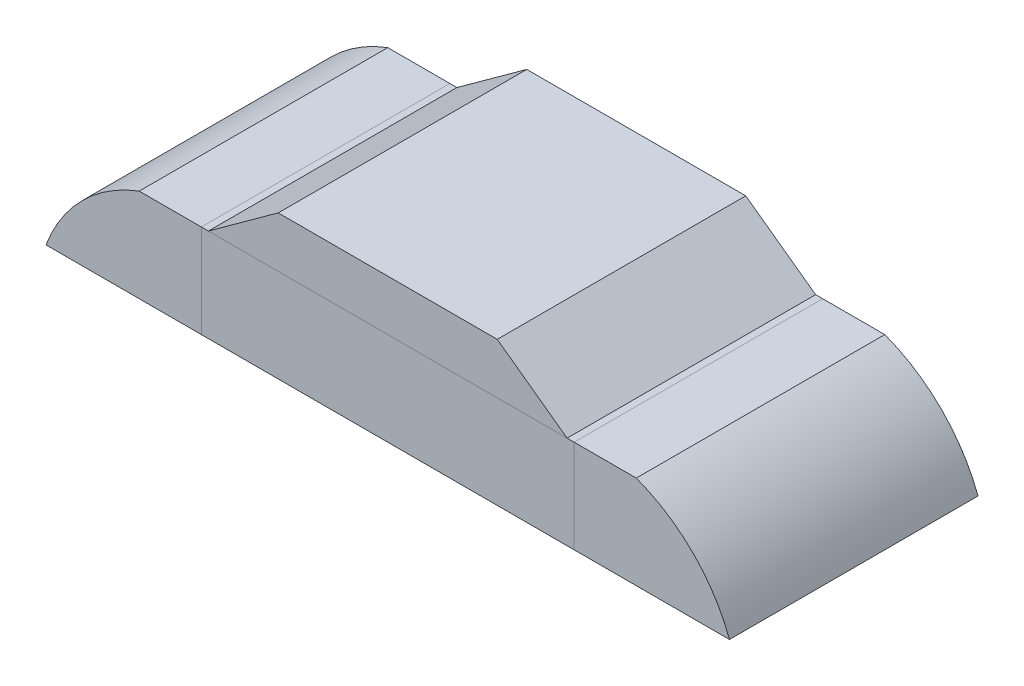
ISO-10303-21;
HEADER;
FILE_DESCRIPTION(('STEP AP214'),'2;1');
FILE_NAME('part.step','',(''),(''),'','','');
FILE_SCHEMA(('AUTOMOTIVE_DESIGN { 1 0 10303 214 1 1 1 1 }'));
ENDSEC;
DATA;
#1=APPLICATION_CONTEXT('core data for automotive mechanical design processes');
#2=APPLICATION_PROTOCOL_DEFINITION('international standard','automotive_design',2000,#1);
#3=PRODUCT_CONTEXT('',#1,'mechanical');
#4=PRODUCT('Part','Part','',(#3));
#5=PRODUCT_RELATED_PRODUCT_CATEGORY('part','',(#4));
#6=PRODUCT_DEFINITION_FORMATION('','',#4);
#7=PRODUCT_DEFINITION_CONTEXT('part definition',#1,'design');
#8=PRODUCT_DEFINITION('design','',#6,#7);
#9=PRODUCT_DEFINITION_SHAPE('','',#8);
#10=(LENGTH_UNIT() NAMED_UNIT(*) SI_UNIT(.MILLI.,.METRE.));
#11=(NAMED_UNIT(*) PLANE_ANGLE_UNIT() SI_UNIT($,.RADIAN.));
#12=(NAMED_UNIT(*) SI_UNIT($,.STERADIAN.) SOLID_ANGLE_UNIT());
#13=UNCERTAINTY_MEASURE_WITH_UNIT(LENGTH_MEASURE(1.E-05),#10,'distance_accuracy_value','');
#14=(GEOMETRIC_REPRESENTATION_CONTEXT(3) GLOBAL_UNCERTAINTY_ASSIGNED_CONTEXT((#13)) GLOBAL_UNIT_ASSIGNED_CONTEXT((#10,
#11,#12)) REPRESENTATION_CONTEXT('',''));
#15=CARTESIAN_POINT('',(0.,0.,0.));
#16=DIRECTION('',(0.,0.,1.));
#17=DIRECTION('',(1.,0.,0.));
#18=AXIS2_PLACEMENT_3D('',#15,#16,#17);
#19=CARTESIAN_POINT('',(0.577336188721218,0.3,0.4));
#20=DIRECTION('',(-0.586919453401064,-0.809645326806371,0.));
#21=DIRECTION('',(0.809645326806372,-0.586919453401064,0.));
#22=AXIS2_PLACEMENT_3D('',#19,#20,#21);
#23=PLANE('',#22);
#24=DIRECTION('',(-0.809645326806372,0.586919453401064,0.));
#25=VECTOR('',#24,1.);
#26=CARTESIAN_POINT('',(0.577336188721218,0.3,-0.4));
#27=LINE('',#26,#25);
#28=CARTESIAN_POINT('',(0.577336188721218,0.3,-0.4));
#29=VERTEX_POINT('',#28);
#30=CARTESIAN_POINT('',(0.352430123235442,0.463036505802082,-0.4));
#31=VERTEX_POINT('',#30);
#32=EDGE_CURVE('E109',#29,#31,#27,.T.);
#33=ORIENTED_EDGE('',*,*,#32,.T.);
#34=DIRECTION('',(0.,0.,-1.));
#35=VECTOR('',#34,1.);
#36=CARTESIAN_POINT('',(0.352430123235442,0.463036505802082,0.4));
#37=LINE('',#36,#35);
#38=CARTESIAN_POINT('',(0.352430123235442,0.463036505802082,0.4));
#39=VERTEX_POINT('',#38);
#40=EDGE_CURVE('E12',#39,#31,#37,.T.);
#41=ORIENTED_EDGE('',*,*,#40,.F.);
#42=DIRECTION('',(-0.809645326806372,0.586919453401064,0.));
#43=VECTOR('',#42,1.);
#44=CARTESIAN_POINT('',(0.577336188721218,0.3,0.4));
#45=LINE('',#44,#43);
#46=CARTESIAN_POINT('',(0.577336188721218,0.3,0.4));
#47=VERTEX_POINT('',#46);
#48=EDGE_CURVE('E97',#47,#39,#45,.T.);
#49=ORIENTED_EDGE('',*,*,#48,.F.);
#50=DIRECTION('',(0.,0.,-1.));
#51=VECTOR('',#50,1.);
#52=CARTESIAN_POINT('',(0.577336188721218,0.3,0.4));
#53=LINE('',#52,#51);
#54=EDGE_CURVE('E105',#47,#29,#53,.T.);
#55=ORIENTED_EDGE('',*,*,#54,.T.);
#56=EDGE_LOOP('',(#33,#41,#49,#55));
#57=FACE_BOUND('',#56,.T.);
#58=ADVANCED_FACE('F46',(#57),#23,.F.);
#59=CARTESIAN_POINT('',(0.352430123235442,0.463036505802082,0.4));
#60=DIRECTION('',(0.,-1.,0.));
#61=DIRECTION('',(0.,0.,-1.));
#62=AXIS2_PLACEMENT_3D('',#59,#60,#61);
#63=PLANE('',#62);
#64=DIRECTION('',(-1.,0.,0.));
#65=VECTOR('',#64,1.);
#66=CARTESIAN_POINT('',(0.352430123235442,0.463036505802082,-0.4));
#67=LINE('',#66,#65);
#68=CARTESIAN_POINT('',(-0.352430123235442,0.463036505802082,-0.4));
#69=VERTEX_POINT('',#68);
#70=EDGE_CURVE('E101',#31,#69,#67,.T.);
#71=ORIENTED_EDGE('',*,*,#70,.T.);
#72=DIRECTION('',(0.,0.,-1.));
#73=VECTOR('',#72,1.);
#74=CARTESIAN_POINT('',(-0.352430123235442,0.463036505802082,0.4));
#75=LINE('',#74,#73);
#76=CARTESIAN_POINT('',(-0.352430123235442,0.463036505802082,0.4));
#77=VERTEX_POINT('',#76);
#78=EDGE_CURVE('E54',#77,#69,#75,.T.);
#79=ORIENTED_EDGE('',*,*,#78,.F.);
#80=DIRECTION('',(-1.,0.,0.));
#81=VECTOR('',#80,1.);
#82=CARTESIAN_POINT('',(0.352430123235442,0.463036505802082,0.4));
#83=LINE('',#82,#81);
#84=EDGE_CURVE('E92',#39,#77,#83,.T.);
#85=ORIENTED_EDGE('',*,*,#84,.F.);
#86=ORIENTED_EDGE('',*,*,#40,.T.);
#87=EDGE_LOOP('',(#71,#79,#85,#86));
#88=FACE_BOUND('',#87,.T.);
#89=ADVANCED_FACE('F100',(#88),#63,.F.);
#90=CARTESIAN_POINT('',(-0.352430123235442,0.463036505802082,0.4));
#91=DIRECTION('',(0.586919453401064,-0.809645326806371,0.));
#92=DIRECTION('',(0.809645326806372,0.586919453401064,0.));
#93=AXIS2_PLACEMENT_3D('',#90,#91,#92);
#94=PLANE('',#93);
#95=DIRECTION('',(-0.809645326806372,-0.586919453401064,0.));
#96=VECTOR('',#95,1.);
#97=CARTESIAN_POINT('',(-0.352430123235442,0.463036505802082,-0.4));
#98=LINE('',#97,#96);
#99=CARTESIAN_POINT('',(-0.577336188721218,0.3,-0.4));
#100=VERTEX_POINT('',#99);
#101=EDGE_CURVE('E79',#69,#100,#98,.T.);
#102=ORIENTED_EDGE('',*,*,#101,.T.);
#103=DIRECTION('',(0.,0.,-1.));
#104=VECTOR('',#103,1.);
#105=CARTESIAN_POINT('',(-0.577336188721218,0.3,0.4));
#106=LINE('',#105,#104);
#107=CARTESIAN_POINT('',(-0.577336188721218,0.3,0.4));
#108=VERTEX_POINT('',#107);
#109=EDGE_CURVE('E102',#108,#100,#106,.T.);
#110=ORIENTED_EDGE('',*,*,#109,.F.);
#111=DIRECTION('',(-0.809645326806372,-0.586919453401064,0.));
#112=VECTOR('',#111,1.);
#113=CARTESIAN_POINT('',(-0.352430123235442,0.463036505802082,0.4));
#114=LINE('',#113,#112);
#115=EDGE_CURVE('E95',#77,#108,#114,.T.);
#116=ORIENTED_EDGE('',*,*,#115,.F.);
#117=ORIENTED_EDGE('',*,*,#78,.T.);
#118=EDGE_LOOP('',(#102,#110,#116,#117));
#119=FACE_BOUND('',#118,.T.);
#120=ADVANCED_FACE('F103',(#119),#94,.F.);
#121=CARTESIAN_POINT('',(0.577336188721218,0.3,0.4));
#122=DIRECTION('',(0.,1.,0.));
#123=DIRECTION('',(0.,0.,1.));
#124=AXIS2_PLACEMENT_3D('',#121,#122,#123);
#125=PLANE('',#124);
#126=DIRECTION('',(1.,0.,0.));
#127=VECTOR('',#126,1.);
#128=CARTESIAN_POINT('',(0.577336188721218,0.3,-0.4));
#129=LINE('',#128,#127);
#130=EDGE_CURVE('E85',#100,#29,#129,.T.);
#131=ORIENTED_EDGE('',*,*,#130,.T.);
#132=ORIENTED_EDGE('',*,*,#54,.F.);
#133=DIRECTION('',(1.,0.,0.));
#134=VECTOR('',#133,1.);
#135=CARTESIAN_POINT('',(0.577336188721218,0.3,0.4));
#136=LINE('',#135,#134);
#137=EDGE_CURVE('E62',#108,#47,#136,.T.);
#138=ORIENTED_EDGE('',*,*,#137,.F.);
#139=ORIENTED_EDGE('',*,*,#109,.T.);
#140=EDGE_LOOP('',(#131,#132,#138,#139));
#141=FACE_BOUND('',#140,.T.);
#142=ADVANCED_FACE('F116',(#141),#125,.F.);
#143=CARTESIAN_POINT('',(0.,0.,0.4));
#144=DIRECTION('',(0.,0.,1.));
#145=DIRECTION('',(1.,0.,0.));
#146=AXIS2_PLACEMENT_3D('',#143,#144,#145);
#147=PLANE('',#146);
#148=ORIENTED_EDGE('',*,*,#48,.T.);
#149=ORIENTED_EDGE('',*,*,#84,.T.);
#150=ORIENTED_EDGE('',*,*,#115,.T.);
#151=ORIENTED_EDGE('',*,*,#137,.T.);
#152=EDGE_LOOP('',(#148,#149,#150,#151));
#153=FACE_BOUND('',#152,.T.);
#154=ADVANCED_FACE('F93',(#153),#147,.T.);
#155=CARTESIAN_POINT('',(0.,0.,-0.4));
#156=DIRECTION('',(0.,0.,1.));
#157=DIRECTION('',(1.,0.,0.));
#158=AXIS2_PLACEMENT_3D('',#155,#156,#157);
#159=PLANE('',#158);
#160=ORIENTED_EDGE('',*,*,#32,.F.);
#161=ORIENTED_EDGE('',*,*,#130,.F.);
#162=ORIENTED_EDGE('',*,*,#101,.F.);
#163=ORIENTED_EDGE('',*,*,#70,.F.);
#164=EDGE_LOOP('',(#160,#161,#162,#163));
#165=FACE_BOUND('',#164,.T.);
#166=ADVANCED_FACE('F119',(#165),#159,.F.);
#167=CLOSED_SHELL('',(#58,#89,#120,#142,#154,#166));
#168=MANIFOLD_SOLID_BREP('B2',#167);
#169=CARTESIAN_POINT('',(0.6,0.,0.4));
#170=DIRECTION('',(1.,0.,0.));
#171=DIRECTION('',(0.,0.,1.));
#172=AXIS2_PLACEMENT_3D('',#169,#170,#171);
#173=PLANE('',#172);
#174=DIRECTION('',(0.,1.,0.));
#175=VECTOR('',#174,1.);
#176=CARTESIAN_POINT('',(0.6,0.,-0.4));
#177=LINE('',#176,#175);
#178=CARTESIAN_POINT('',(0.6,0.,-0.4));
#179=VERTEX_POINT('',#178);
#180=CARTESIAN_POINT('',(0.6,0.3,-0.4));
#181=VERTEX_POINT('',#180);
#182=EDGE_CURVE('E243',#179,#181,#177,.T.);
#183=ORIENTED_EDGE('',*,*,#182,.F.);
#184=DIRECTION('',(0.,0.,-1.));
#185=VECTOR('',#184,1.);
#186=CARTESIAN_POINT('',(0.6,0.,0.4));
#187=LINE('',#186,#185);
#188=CARTESIAN_POINT('',(0.6,0.,0.4));
#189=VERTEX_POINT('',#188);
#190=EDGE_CURVE('E242',#189,#179,#187,.T.);
#191=ORIENTED_EDGE('',*,*,#190,.F.);
#192=DIRECTION('',(0.,1.,0.));
#193=VECTOR('',#192,1.);
#194=CARTESIAN_POINT('',(0.6,0.,0.4));
#195=LINE('',#194,#193);
#196=CARTESIAN_POINT('',(0.6,0.3,0.4));
#197=VERTEX_POINT('',#196);
#198=EDGE_CURVE('E237',#189,#197,#195,.T.);
#199=ORIENTED_EDGE('',*,*,#198,.T.);
#200=DIRECTION('',(0.,0.,-1.));
#201=VECTOR('',#200,1.);
#202=CARTESIAN_POINT('',(0.6,0.3,0.4));
#203=LINE('',#202,#201);
#204=EDGE_CURVE('E44',#197,#181,#203,.T.);
#205=ORIENTED_EDGE('',*,*,#204,.T.);
#206=EDGE_LOOP('',(#183,#191,#199,#205));
#207=FACE_BOUND('',#206,.T.);
#208=ADVANCED_FACE('F180',(#207),#173,.F.);
#209=CARTESIAN_POINT('',(0.6,0.3,0.4));
#210=DIRECTION('',(0.,-1.,0.));
#211=DIRECTION('',(0.,0.,-1.));
#212=AXIS2_PLACEMENT_3D('',#209,#210,#211);
#213=PLANE('',#212);
#214=DIRECTION('',(1.,0.,0.));
#215=VECTOR('',#214,1.);
#216=CARTESIAN_POINT('',(0.6,0.3,-0.4));
#217=LINE('',#216,#215);
#218=CARTESIAN_POINT('',(0.8,0.3,-0.4));
#219=VERTEX_POINT('',#218);
#220=EDGE_CURVE('E245',#181,#219,#217,.T.);
#221=ORIENTED_EDGE('',*,*,#220,.F.);
#222=ORIENTED_EDGE('',*,*,#204,.F.);
#223=DIRECTION('',(1.,0.,0.));
#224=VECTOR('',#223,1.);
#225=CARTESIAN_POINT('',(0.6,0.3,0.4));
#226=LINE('',#225,#224);
#227=CARTESIAN_POINT('',(0.8,0.3,0.4));
#228=VERTEX_POINT('',#227);
#229=EDGE_CURVE('E221',#197,#228,#226,.T.);
#230=ORIENTED_EDGE('',*,*,#229,.T.);
#231=DIRECTION('',(0.,0.,-1.));
#232=VECTOR('',#231,1.);
#233=CARTESIAN_POINT('',(0.8,0.3,0.4));
#234=LINE('',#233,#232);
#235=EDGE_CURVE('E188',#228,#219,#234,.T.);
#236=ORIENTED_EDGE('',*,*,#235,.T.);
#237=EDGE_LOOP('',(#221,#222,#230,#236));
#238=FACE_BOUND('',#237,.T.);
#239=ADVANCED_FACE('F235',(#238),#213,.F.);
#240=CARTESIAN_POINT('',(0.621349842311436,-0.178650157688564,0.4));
#241=DIRECTION('',(0.,0.,-1.));
#242=DIRECTION('',(1.,0.,0.));
#243=AXIS2_PLACEMENT_3D('',#240,#241,#242);
#244=CYLINDRICAL_SURFACE('',#243,0.510902977381651);
#245=CARTESIAN_POINT('',(0.621349842311436,-0.178650157688564,-0.4));
#246=DIRECTION('',(0.,0.,-1.));
#247=DIRECTION('',(-1.,0.,0.));
#248=AXIS2_PLACEMENT_3D('',#245,#246,#247);
#249=CIRCLE('',#248,0.510902977381651);
#250=CARTESIAN_POINT('',(1.1,0.,-0.4));
#251=VERTEX_POINT('',#250);
#252=EDGE_CURVE('E231',#219,#251,#249,.T.);
#253=ORIENTED_EDGE('',*,*,#252,.F.);
#254=ORIENTED_EDGE('',*,*,#235,.F.);
#255=CARTESIAN_POINT('',(0.621349842311436,-0.178650157688564,0.4));
#256=DIRECTION('',(0.,0.,-1.));
#257=DIRECTION('',(-1.,0.,0.));
#258=AXIS2_PLACEMENT_3D('',#255,#256,#257);
#259=CIRCLE('',#258,0.510902977381651);
#260=CARTESIAN_POINT('',(1.1,0.,0.4));
#261=VERTEX_POINT('',#260);
#262=EDGE_CURVE('E224',#228,#261,#259,.T.);
#263=ORIENTED_EDGE('',*,*,#262,.T.);
#264=DIRECTION('',(0.,0.,-1.));
#265=VECTOR('',#264,1.);
#266=CARTESIAN_POINT('',(1.1,0.,0.4));
#267=LINE('',#266,#265);
#268=EDGE_CURVE('E234',#261,#251,#267,.T.);
#269=ORIENTED_EDGE('',*,*,#268,.T.);
#270=EDGE_LOOP('',(#253,#254,#263,#269));
#271=FACE_BOUND('',#270,.T.);
#272=ADVANCED_FACE('F230',(#271),#244,.T.);
#273=CARTESIAN_POINT('',(1.1,0.,0.4));
#274=DIRECTION('',(0.,1.,0.));
#275=DIRECTION('',(0.,0.,1.));
#276=AXIS2_PLACEMENT_3D('',#273,#274,#275);
#277=PLANE('',#276);
#278=DIRECTION('',(-1.,0.,0.));
#279=VECTOR('',#278,1.);
#280=CARTESIAN_POINT('',(1.1,0.,-0.4));
#281=LINE('',#280,#279);
#282=EDGE_CURVE('E210',#251,#179,#281,.T.);
#283=ORIENTED_EDGE('',*,*,#282,.F.);
#284=ORIENTED_EDGE('',*,*,#268,.F.);
#285=DIRECTION('',(-1.,0.,0.));
#286=VECTOR('',#285,1.);
#287=CARTESIAN_POINT('',(1.1,0.,0.4));
#288=LINE('',#287,#286);
#289=EDGE_CURVE('E196',#261,#189,#288,.T.);
#290=ORIENTED_EDGE('',*,*,#289,.T.);
#291=ORIENTED_EDGE('',*,*,#190,.T.);
#292=EDGE_LOOP('',(#283,#284,#290,#291));
#293=FACE_BOUND('',#292,.T.);
#294=ADVANCED_FACE('F254',(#293),#277,.F.);
#295=CARTESIAN_POINT('',(0.621349842311436,-0.178650157688564,0.4));
#296=DIRECTION('',(0.,0.,1.));
#297=DIRECTION('',(-1.,0.,0.));
#298=AXIS2_PLACEMENT_3D('',#295,#296,#297);
#299=PLANE('',#298);
#300=ORIENTED_EDGE('',*,*,#198,.F.);
#301=ORIENTED_EDGE('',*,*,#289,.F.);
#302=ORIENTED_EDGE('',*,*,#262,.F.);
#303=ORIENTED_EDGE('',*,*,#229,.F.);
#304=EDGE_LOOP('',(#300,#301,#302,#303));
#305=FACE_BOUND('',#304,.T.);
#306=ADVANCED_FACE('F226',(#305),#299,.T.);
#307=CARTESIAN_POINT('',(0.621349842311436,-0.178650157688564,-0.4));
#308=DIRECTION('',(0.,0.,1.));
#309=DIRECTION('',(-1.,0.,0.));
#310=AXIS2_PLACEMENT_3D('',#307,#308,#309);
#311=PLANE('',#310);
#312=ORIENTED_EDGE('',*,*,#182,.T.);
#313=ORIENTED_EDGE('',*,*,#220,.T.);
#314=ORIENTED_EDGE('',*,*,#252,.T.);
#315=ORIENTED_EDGE('',*,*,#282,.T.);
#316=EDGE_LOOP('',(#312,#313,#314,#315));
#317=FACE_BOUND('',#316,.T.);
#318=ADVANCED_FACE('F250',(#317),#311,.F.);
#319=CLOSED_SHELL('',(#208,#239,#272,#294,#306,#318));
#320=MANIFOLD_SOLID_BREP('B6',#319);
#321=CARTESIAN_POINT('',(-0.6,0.,0.4));
#322=DIRECTION('',(-1.,0.,0.));
#323=DIRECTION('',(0.,0.,1.));
#324=AXIS2_PLACEMENT_3D('',#321,#322,#323);
#325=PLANE('',#324);
#326=DIRECTION('',(0.,1.,0.));
#327=VECTOR('',#326,1.);
#328=CARTESIAN_POINT('',(-0.6,0.,-0.4));
#329=LINE('',#328,#327);
#330=CARTESIAN_POINT('',(-0.6,0.,-0.4));
#331=VERTEX_POINT('',#330);
#332=CARTESIAN_POINT('',(-0.6,0.3,-0.4));
#333=VERTEX_POINT('',#332);
#334=EDGE_CURVE('E376',#331,#333,#329,.T.);
#335=ORIENTED_EDGE('',*,*,#334,.T.);
#336=DIRECTION('',(0.,0.,-1.));
#337=VECTOR('',#336,1.);
#338=CARTESIAN_POINT('',(-0.6,0.3,0.4));
#339=LINE('',#338,#337);
#340=CARTESIAN_POINT('',(-0.6,0.3,0.4));
#341=VERTEX_POINT('',#340);
#342=EDGE_CURVE('E178',#341,#333,#339,.T.);
#343=ORIENTED_EDGE('',*,*,#342,.F.);
#344=DIRECTION('',(0.,1.,0.));
#345=VECTOR('',#344,1.);
#346=CARTESIAN_POINT('',(-0.6,0.,0.4));
#347=LINE('',#346,#345);
#348=CARTESIAN_POINT('',(-0.6,0.,0.4));
#349=VERTEX_POINT('',#348);
#350=EDGE_CURVE('E364',#349,#341,#347,.T.);
#351=ORIENTED_EDGE('',*,*,#350,.F.);
#352=DIRECTION('',(0.,0.,-1.));
#353=VECTOR('',#352,1.);
#354=CARTESIAN_POINT('',(-0.6,0.,0.4));
#355=LINE('',#354,#353);
#356=EDGE_CURVE('E372',#349,#331,#355,.T.);
#357=ORIENTED_EDGE('',*,*,#356,.T.);
#358=EDGE_LOOP('',(#335,#343,#351,#357));
#359=FACE_BOUND('',#358,.T.);
#360=ADVANCED_FACE('F313',(#359),#325,.F.);
#361=CARTESIAN_POINT('',(-0.6,0.3,0.4));
#362=DIRECTION('',(0.,-1.,0.));
#363=DIRECTION('',(0.,0.,-1.));
#364=AXIS2_PLACEMENT_3D('',#361,#362,#363);
#365=PLANE('',#364);
#366=DIRECTION('',(-1.,0.,0.));
#367=VECTOR('',#366,1.);
#368=CARTESIAN_POINT('',(-0.6,0.3,-0.4));
#369=LINE('',#368,#367);
#370=CARTESIAN_POINT('',(-0.8,0.3,-0.4));
#371=VERTEX_POINT('',#370);
#372=EDGE_CURVE('E368',#333,#371,#369,.T.);
#373=ORIENTED_EDGE('',*,*,#372,.T.);
#374=DIRECTION('',(0.,0.,-1.));
#375=VECTOR('',#374,1.);
#376=CARTESIAN_POINT('',(-0.8,0.3,0.4));
#377=LINE('',#376,#375);
#378=CARTESIAN_POINT('',(-0.8,0.3,0.4));
#379=VERTEX_POINT('',#378);
#380=EDGE_CURVE('E321',#379,#371,#377,.T.);
#381=ORIENTED_EDGE('',*,*,#380,.F.);
#382=DIRECTION('',(-1.,0.,0.));
#383=VECTOR('',#382,1.);
#384=CARTESIAN_POINT('',(-0.6,0.3,0.4));
#385=LINE('',#384,#383);
#386=EDGE_CURVE('E359',#341,#379,#385,.T.);
#387=ORIENTED_EDGE('',*,*,#386,.F.);
#388=ORIENTED_EDGE('',*,*,#342,.T.);
#389=EDGE_LOOP('',(#373,#381,#387,#388));
#390=FACE_BOUND('',#389,.T.);
#391=ADVANCED_FACE('F367',(#390),#365,.F.);
#392=CARTESIAN_POINT('',(-0.621349842311436,-0.178650157688564,0.4));
#393=DIRECTION('',(0.,0.,-1.));
#394=DIRECTION('',(-1.,0.,0.));
#395=AXIS2_PLACEMENT_3D('',#392,#393,#394);
#396=CYLINDRICAL_SURFACE('',#395,0.510902977381651);
#397=CARTESIAN_POINT('',(-0.621349842311436,-0.178650157688564,-0.4));
#398=DIRECTION('',(0.,0.,1.));
#399=DIRECTION('',(1.,0.,0.));
#400=AXIS2_PLACEMENT_3D('',#397,#398,#399);
#401=CIRCLE('',#400,0.510902977381651);
#402=CARTESIAN_POINT('',(-1.1,0.,-0.4));
#403=VERTEX_POINT('',#402);
#404=EDGE_CURVE('E346',#371,#403,#401,.T.);
#405=ORIENTED_EDGE('',*,*,#404,.T.);
#406=DIRECTION('',(0.,0.,-1.));
#407=VECTOR('',#406,1.);
#408=CARTESIAN_POINT('',(-1.1,0.,0.4));
#409=LINE('',#408,#407);
#410=CARTESIAN_POINT('',(-1.1,0.,0.4));
#411=VERTEX_POINT('',#410);
#412=EDGE_CURVE('E369',#411,#403,#409,.T.);
#413=ORIENTED_EDGE('',*,*,#412,.F.);
#414=CARTESIAN_POINT('',(-0.621349842311436,-0.178650157688564,0.4));
#415=DIRECTION('',(0.,0.,1.));
#416=DIRECTION('',(1.,0.,0.));
#417=AXIS2_PLACEMENT_3D('',#414,#415,#416);
#418=CIRCLE('',#417,0.510902977381651);
#419=EDGE_CURVE('E362',#379,#411,#418,.T.);
#420=ORIENTED_EDGE('',*,*,#419,.F.);
#421=ORIENTED_EDGE('',*,*,#380,.T.);
#422=EDGE_LOOP('',(#405,#413,#420,#421));
#423=FACE_BOUND('',#422,.T.);
#424=ADVANCED_FACE('F370',(#423),#396,.T.);
#425=CARTESIAN_POINT('',(-1.1,0.,0.4));
#426=DIRECTION('',(0.,1.,0.));
#427=DIRECTION('',(0.,0.,1.));
#428=AXIS2_PLACEMENT_3D('',#425,#426,#427);
#429=PLANE('',#428);
#430=DIRECTION('',(1.,0.,0.));
#431=VECTOR('',#430,1.);
#432=CARTESIAN_POINT('',(-1.1,0.,-0.4));
#433=LINE('',#432,#431);
#434=EDGE_CURVE('E352',#403,#331,#433,.T.);
#435=ORIENTED_EDGE('',*,*,#434,.T.);
#436=ORIENTED_EDGE('',*,*,#356,.F.);
#437=DIRECTION('',(1.,0.,0.));
#438=VECTOR('',#437,1.);
#439=CARTESIAN_POINT('',(-1.1,0.,0.4));
#440=LINE('',#439,#438);
#441=EDGE_CURVE('E329',#411,#349,#440,.T.);
#442=ORIENTED_EDGE('',*,*,#441,.F.);
#443=ORIENTED_EDGE('',*,*,#412,.T.);
#444=EDGE_LOOP('',(#435,#436,#442,#443));
#445=FACE_BOUND('',#444,.T.);
#446=ADVANCED_FACE('F383',(#445),#429,.F.);
#447=CARTESIAN_POINT('',(-0.621349842311436,-0.178650157688564,0.4));
#448=DIRECTION('',(0.,0.,1.));
#449=DIRECTION('',(1.,0.,0.));
#450=AXIS2_PLACEMENT_3D('',#447,#448,#449);
#451=PLANE('',#450);
#452=ORIENTED_EDGE('',*,*,#350,.T.);
#453=ORIENTED_EDGE('',*,*,#386,.T.);
#454=ORIENTED_EDGE('',*,*,#419,.T.);
#455=ORIENTED_EDGE('',*,*,#441,.T.);
#456=EDGE_LOOP('',(#452,#453,#454,#455));
#457=FACE_BOUND('',#456,.T.);
#458=ADVANCED_FACE('F360',(#457),#451,.T.);
#459=CARTESIAN_POINT('',(-0.621349842311436,-0.178650157688564,-0.4));
#460=DIRECTION('',(0.,0.,1.));
#461=DIRECTION('',(1.,0.,0.));
#462=AXIS2_PLACEMENT_3D('',#459,#460,#461);
#463=PLANE('',#462);
#464=ORIENTED_EDGE('',*,*,#334,.F.);
#465=ORIENTED_EDGE('',*,*,#434,.F.);
#466=ORIENTED_EDGE('',*,*,#404,.F.);
#467=ORIENTED_EDGE('',*,*,#372,.F.);
#468=EDGE_LOOP('',(#464,#465,#466,#467));
#469=FACE_BOUND('',#468,.T.);
#470=ADVANCED_FACE('F386',(#469),#463,.F.);
#471=CLOSED_SHELL('',(#360,#391,#424,#446,#458,#470));
#472=MANIFOLD_SOLID_BREP('B38',#471);
#473=CARTESIAN_POINT('',(0.,0.3,0.));
#474=DIRECTION('',(0.,-1.,0.));
#475=DIRECTION('',(0.,0.,-1.));
#476=AXIS2_PLACEMENT_3D('',#473,#474,#475);
#477=PLANE('',#476);
#478=DIRECTION('',(0.,0.,-1.));
#479=VECTOR('',#478,1.);
#480=CARTESIAN_POINT('',(0.6,0.3,0.4));
#481=LINE('',#480,#479);
#482=CARTESIAN_POINT('',(0.6,0.3,0.4));
#483=VERTEX_POINT('',#482);
#484=CARTESIAN_POINT('',(0.6,0.3,-0.4));
#485=VERTEX_POINT('',#484);
#486=EDGE_CURVE('E490',#483,#485,#481,.T.);
#487=ORIENTED_EDGE('',*,*,#486,.T.);
#488=DIRECTION('',(-1.,0.,0.));
#489=VECTOR('',#488,1.);
#490=CARTESIAN_POINT('',(-0.6,0.3,-0.4));
#491=LINE('',#490,#489);
#492=CARTESIAN_POINT('',(-0.6,0.3,-0.4));
#493=VERTEX_POINT('',#492);
#494=EDGE_CURVE('E485',#485,#493,#491,.T.);
#495=ORIENTED_EDGE('',*,*,#494,.T.);
#496=DIRECTION('',(0.,0.,1.));
#497=VECTOR('',#496,1.);
#498=CARTESIAN_POINT('',(-0.6,0.3,0.4));
#499=LINE('',#498,#497);
#500=CARTESIAN_POINT('',(-0.6,0.3,0.4));
#501=VERTEX_POINT('',#500);
#502=EDGE_CURVE('E488',#493,#501,#499,.T.);
#503=ORIENTED_EDGE('',*,*,#502,.T.);
#504=DIRECTION('',(1.,0.,0.));
#505=VECTOR('',#504,1.);
#506=CARTESIAN_POINT('',(-0.6,0.3,0.4));
#507=LINE('',#506,#505);
#508=EDGE_CURVE('E454',#501,#483,#507,.T.);
#509=ORIENTED_EDGE('',*,*,#508,.T.);
#510=EDGE_LOOP('',(#487,#495,#503,#509));
#511=FACE_BOUND('',#510,.T.);
#512=CARTESIAN_POINT('',(0.,0.3,0.));
#513=DIRECTION('',(0.,-1.,0.));
#514=DIRECTION('',(0.,0.,-1.));
#515=AXIS2_PLACEMENT_3D('',#512,#513,#514);
#516=CIRCLE('',#515,0.2);
#517=CARTESIAN_POINT('',(0.,0.3,-0.2));
#518=VERTEX_POINT('',#517);
#519=EDGE_CURVE('E311',#518,#518,#516,.F.);
#520=ORIENTED_EDGE('',*,*,#519,.F.);
#521=EDGE_LOOP('',(#520));
#522=FACE_BOUND('',#521,.T.);
#523=ADVANCED_FACE('F437',(#511,#522),#477,.F.);
#524=CARTESIAN_POINT('',(0.6,0.3,0.4));
#525=DIRECTION('',(-1.,0.,0.));
#526=DIRECTION('',(0.,0.,1.));
#527=AXIS2_PLACEMENT_3D('',#524,#525,#526);
#528=PLANE('',#527);
#529=DIRECTION('',(0.,0.,-1.));
#530=VECTOR('',#529,1.);
#531=CARTESIAN_POINT('',(0.6,0.,0.4));
#532=LINE('',#531,#530);
#533=CARTESIAN_POINT('',(0.6,0.,0.4));
#534=VERTEX_POINT('',#533);
#535=CARTESIAN_POINT('',(0.6,0.,-0.4));
#536=VERTEX_POINT('',#535);
#537=EDGE_CURVE('E504',#534,#536,#532,.T.);
#538=ORIENTED_EDGE('',*,*,#537,.T.);
#539=DIRECTION('',(0.,-1.,0.));
#540=VECTOR('',#539,1.);
#541=CARTESIAN_POINT('',(0.6,0.3,-0.4));
#542=LINE('',#541,#540);
#543=EDGE_CURVE('E446',#485,#536,#542,.T.);
#544=ORIENTED_EDGE('',*,*,#543,.F.);
#545=ORIENTED_EDGE('',*,*,#486,.F.);
#546=DIRECTION('',(0.,-1.,0.));
#547=VECTOR('',#546,1.);
#548=CARTESIAN_POINT('',(0.6,0.3,0.4));
#549=LINE('',#548,#547);
#550=EDGE_CURVE('E500',#483,#534,#549,.T.);
#551=ORIENTED_EDGE('',*,*,#550,.T.);
#552=EDGE_LOOP('',(#538,#544,#545,#551));
#553=FACE_BOUND('',#552,.T.);
#554=ADVANCED_FACE('F439',(#553),#528,.F.);
#555=CARTESIAN_POINT('',(-0.6,0.3,-0.4));
#556=DIRECTION('',(0.,0.,1.));
#557=DIRECTION('',(1.,0.,0.));
#558=AXIS2_PLACEMENT_3D('',#555,#556,#557);
#559=PLANE('',#558);
#560=DIRECTION('',(-1.,0.,0.));
#561=VECTOR('',#560,1.);
#562=CARTESIAN_POINT('',(-0.6,0.,-0.4));
#563=LINE('',#562,#561);
#564=CARTESIAN_POINT('',(-0.6,0.,-0.4));
#565=VERTEX_POINT('',#564);
#566=EDGE_CURVE('E495',#536,#565,#563,.T.);
#567=ORIENTED_EDGE('',*,*,#566,.T.);
#568=DIRECTION('',(0.,-1.,0.));
#569=VECTOR('',#568,1.);
#570=CARTESIAN_POINT('',(-0.6,0.3,-0.4));
#571=LINE('',#570,#569);
#572=EDGE_CURVE('E493',#493,#565,#571,.T.);
#573=ORIENTED_EDGE('',*,*,#572,.F.);
#574=ORIENTED_EDGE('',*,*,#494,.F.);
#575=ORIENTED_EDGE('',*,*,#543,.T.);
#576=EDGE_LOOP('',(#567,#573,#574,#575));
#577=FACE_BOUND('',#576,.T.);
#578=ADVANCED_FACE('F494',(#577),#559,.F.);
#579=CARTESIAN_POINT('',(-0.6,0.3,0.4));
#580=DIRECTION('',(1.,0.,0.));
#581=DIRECTION('',(0.,0.,-1.));
#582=AXIS2_PLACEMENT_3D('',#579,#580,#581);
#583=PLANE('',#582);
#584=DIRECTION('',(0.,0.,1.));
#585=VECTOR('',#584,1.);
#586=CARTESIAN_POINT('',(-0.6,0.,0.4));
#587=LINE('',#586,#585);
#588=CARTESIAN_POINT('',(-0.6,0.,0.4));
#589=VERTEX_POINT('',#588);
#590=EDGE_CURVE('E471',#565,#589,#587,.T.);
#591=ORIENTED_EDGE('',*,*,#590,.T.);
#592=DIRECTION('',(0.,-1.,0.));
#593=VECTOR('',#592,1.);
#594=CARTESIAN_POINT('',(-0.6,0.3,0.4));
#595=LINE('',#594,#593);
#596=EDGE_CURVE('E496',#501,#589,#595,.T.);
#597=ORIENTED_EDGE('',*,*,#596,.F.);
#598=ORIENTED_EDGE('',*,*,#502,.F.);
#599=ORIENTED_EDGE('',*,*,#572,.T.);
#600=EDGE_LOOP('',(#591,#597,#598,#599));
#601=FACE_BOUND('',#600,.T.);
#602=ADVANCED_FACE('F498',(#601),#583,.F.);
#603=CARTESIAN_POINT('',(-0.6,0.3,0.4));
#604=DIRECTION('',(0.,0.,-1.));
#605=DIRECTION('',(-1.,0.,0.));
#606=AXIS2_PLACEMENT_3D('',#603,#604,#605);
#607=PLANE('',#606);
#608=DIRECTION('',(1.,0.,0.));
#609=VECTOR('',#608,1.);
#610=CARTESIAN_POINT('',(-0.6,0.,0.4));
#611=LINE('',#610,#609);
#612=EDGE_CURVE('E477',#589,#534,#611,.T.);
#613=ORIENTED_EDGE('',*,*,#612,.T.);
#614=ORIENTED_EDGE('',*,*,#550,.F.);
#615=ORIENTED_EDGE('',*,*,#508,.F.);
#616=ORIENTED_EDGE('',*,*,#596,.T.);
#617=EDGE_LOOP('',(#613,#614,#615,#616));
#618=FACE_BOUND('',#617,.T.);
#619=ADVANCED_FACE('F518',(#618),#607,.F.);
#620=CARTESIAN_POINT('',(0.,0.,0.));
#621=DIRECTION('',(0.,-1.,0.));
#622=DIRECTION('',(0.,0.,-1.));
#623=AXIS2_PLACEMENT_3D('',#620,#621,#622);
#624=PLANE('',#623);
#625=ORIENTED_EDGE('',*,*,#537,.F.);
#626=ORIENTED_EDGE('',*,*,#612,.F.);
#627=ORIENTED_EDGE('',*,*,#590,.F.);
#628=ORIENTED_EDGE('',*,*,#566,.F.);
#629=EDGE_LOOP('',(#625,#626,#627,#628));
#630=FACE_BOUND('',#629,.T.);
#631=ADVANCED_FACE('F515',(#630),#624,.T.);
#632=CARTESIAN_POINT('',(0.,0.809216281577376,0.));
#633=DIRECTION('',(0.,1.,0.));
#634=DIRECTION('',(0.,0.,1.));
#635=AXIS2_PLACEMENT_3D('',#632,#633,#634);
#636=CYLINDRICAL_SURFACE('',#635,0.2);
#637=CARTESIAN_POINT('',(0.,0.4,0.));
#638=DIRECTION('',(0.,1.,0.));
#639=DIRECTION('',(0.,0.,1.));
#640=AXIS2_PLACEMENT_3D('',#637,#638,#639);
#641=CIRCLE('',#640,0.2);
#642=CARTESIAN_POINT('',(0.,0.4,0.2));
#643=VERTEX_POINT('',#642);
#644=EDGE_CURVE('E507',#643,#643,#641,.T.);
#645=ORIENTED_EDGE('',*,*,#644,.F.);
#646=EDGE_LOOP('',(#645));
#647=FACE_BOUND('',#646,.T.);
#648=ORIENTED_EDGE('',*,*,#519,.T.);
#649=EDGE_LOOP('',(#648));
#650=FACE_BOUND('',#649,.T.);
#651=ADVANCED_FACE('F517',(#647,#650),#636,.T.);
#652=CARTESIAN_POINT('',(0.,0.4,0.));
#653=DIRECTION('',(0.,-1.,0.));
#654=DIRECTION('',(0.,0.,-1.));
#655=AXIS2_PLACEMENT_3D('',#652,#653,#654);
#656=PLANE('',#655);
#657=ORIENTED_EDGE('',*,*,#644,.T.);
#658=EDGE_LOOP('',(#657));
#659=FACE_BOUND('',#658,.T.);
#660=ADVANCED_FACE('F524',(#659),#656,.F.);
#661=CLOSED_SHELL('',(#523,#554,#578,#602,#619,#631,#651,#660));
#662=MANIFOLD_SOLID_BREP('B172',#661);
#663=ADVANCED_BREP_SHAPE_REPRESENTATION('',(#18,#168,#320,#472,#662),#14);
#664=SHAPE_DEFINITION_REPRESENTATION(#9,#663);
ENDSEC;
END-ISO-10303-21;
